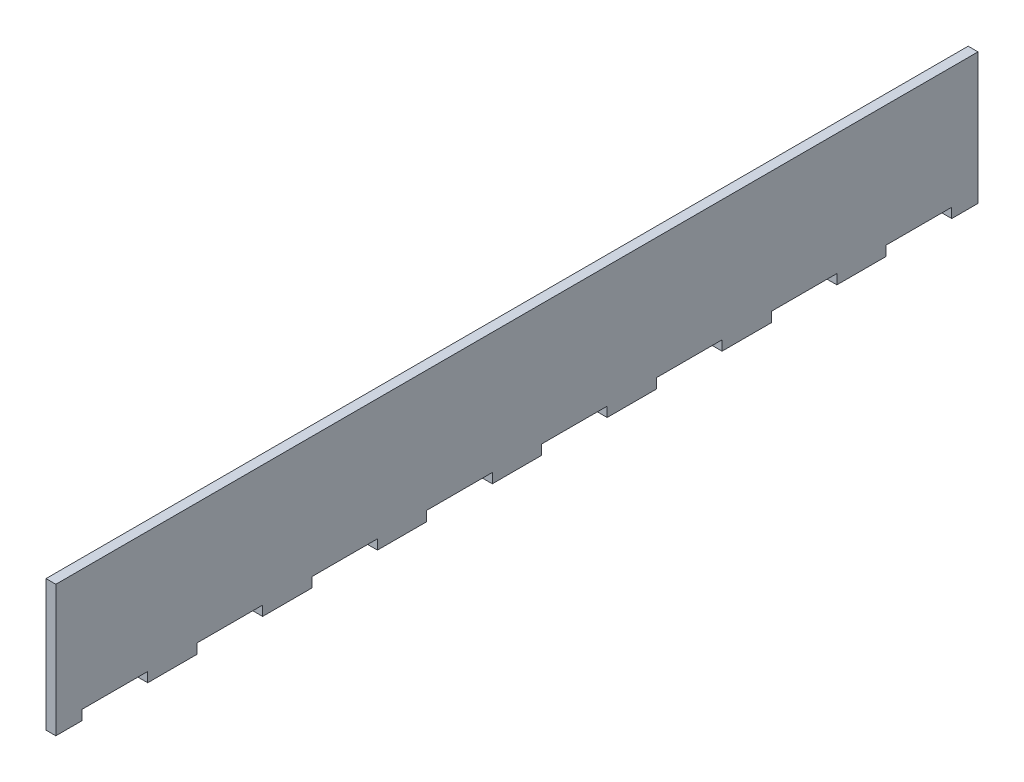
ISO-10303-21;
HEADER;
FILE_DESCRIPTION(('STEP AP214'),'2;1');
FILE_NAME('part.step','',(''),(''),'','','');
FILE_SCHEMA(('AUTOMOTIVE_DESIGN { 1 0 10303 214 1 1 1 1 }'));
ENDSEC;
DATA;
#1=APPLICATION_CONTEXT('core data for automotive mechanical design processes');
#2=APPLICATION_PROTOCOL_DEFINITION('international standard','automotive_design',2000,#1);
#3=PRODUCT_CONTEXT('',#1,'mechanical');
#4=PRODUCT('Part','Part','',(#3));
#5=PRODUCT_RELATED_PRODUCT_CATEGORY('part','',(#4));
#6=PRODUCT_DEFINITION_FORMATION('','',#4);
#7=PRODUCT_DEFINITION_CONTEXT('part definition',#1,'design');
#8=PRODUCT_DEFINITION('design','',#6,#7);
#9=PRODUCT_DEFINITION_SHAPE('','',#8);
#10=(LENGTH_UNIT() NAMED_UNIT(*) SI_UNIT(.MILLI.,.METRE.));
#11=(NAMED_UNIT(*) PLANE_ANGLE_UNIT() SI_UNIT($,.RADIAN.));
#12=(NAMED_UNIT(*) SI_UNIT($,.STERADIAN.) SOLID_ANGLE_UNIT());
#13=UNCERTAINTY_MEASURE_WITH_UNIT(LENGTH_MEASURE(1.E-05),#10,'distance_accuracy_value','');
#14=(GEOMETRIC_REPRESENTATION_CONTEXT(3) GLOBAL_UNCERTAINTY_ASSIGNED_CONTEXT((#13)) GLOBAL_UNIT_ASSIGNED_CONTEXT((#10,
#11,#12)) REPRESENTATION_CONTEXT('',''));
#15=CARTESIAN_POINT('',(0.,0.,0.));
#16=DIRECTION('',(0.,0.,1.));
#17=DIRECTION('',(1.,0.,0.));
#18=AXIS2_PLACEMENT_3D('',#15,#16,#17);
#19=CARTESIAN_POINT('',(3.,0.,0.));
#20=DIRECTION('',(0.,0.,1.));
#21=DIRECTION('',(1.,0.,0.));
#22=AXIS2_PLACEMENT_3D('',#19,#20,#21);
#23=PLANE('',#22);
#24=DIRECTION('',(0.,1.,0.));
#25=VECTOR('',#24,1.);
#26=CARTESIAN_POINT('',(0.,0.,0.));
#27=LINE('',#26,#25);
#28=CARTESIAN_POINT('',(0.,0.,0.));
#29=VERTEX_POINT('',#28);
#30=CARTESIAN_POINT('',(0.,40.,0.));
#31=VERTEX_POINT('',#30);
#32=EDGE_CURVE('E300',#29,#31,#27,.T.);
#33=ORIENTED_EDGE('',*,*,#32,.F.);
#34=DIRECTION('',(-1.,0.,0.));
#35=VECTOR('',#34,1.);
#36=CARTESIAN_POINT('',(3.,0.,0.));
#37=LINE('',#36,#35);
#38=CARTESIAN_POINT('',(3.,0.,0.));
#39=VERTEX_POINT('',#38);
#40=EDGE_CURVE('E11',#39,#29,#37,.T.);
#41=ORIENTED_EDGE('',*,*,#40,.F.);
#42=DIRECTION('',(0.,1.,0.));
#43=VECTOR('',#42,1.);
#44=CARTESIAN_POINT('',(3.,0.,0.));
#45=LINE('',#44,#43);
#46=CARTESIAN_POINT('',(3.,40.,0.));
#47=VERTEX_POINT('',#46);
#48=EDGE_CURVE('E387',#39,#47,#45,.T.);
#49=ORIENTED_EDGE('',*,*,#48,.T.);
#50=DIRECTION('',(-1.,0.,0.));
#51=VECTOR('',#50,1.);
#52=CARTESIAN_POINT('',(3.,40.,0.));
#53=LINE('',#52,#51);
#54=EDGE_CURVE('E36',#47,#31,#53,.T.);
#55=ORIENTED_EDGE('',*,*,#54,.T.);
#56=EDGE_LOOP('',(#33,#41,#49,#55));
#57=FACE_BOUND('',#56,.T.);
#58=ADVANCED_FACE('F33',(#57),#23,.T.);
#59=CARTESIAN_POINT('',(3.,0.,0.));
#60=DIRECTION('',(0.,1.,0.));
#61=DIRECTION('',(0.,0.,1.));
#62=AXIS2_PLACEMENT_3D('',#59,#60,#61);
#63=PLANE('',#62);
#64=DIRECTION('',(0.,0.,-1.));
#65=VECTOR('',#64,1.);
#66=CARTESIAN_POINT('',(0.,0.,0.));
#67=LINE('',#66,#65);
#68=CARTESIAN_POINT('',(0.,0.,-8.));
#69=VERTEX_POINT('',#68);
#70=EDGE_CURVE('E162',#29,#69,#67,.T.);
#71=ORIENTED_EDGE('',*,*,#70,.T.);
#72=DIRECTION('',(-1.,0.,0.));
#73=VECTOR('',#72,1.);
#74=CARTESIAN_POINT('',(3.,0.,-8.));
#75=LINE('',#74,#73);
#76=CARTESIAN_POINT('',(3.,0.,-8.));
#77=VERTEX_POINT('',#76);
#78=EDGE_CURVE('E42',#77,#69,#75,.T.);
#79=ORIENTED_EDGE('',*,*,#78,.F.);
#80=DIRECTION('',(0.,0.,-1.));
#81=VECTOR('',#80,1.);
#82=CARTESIAN_POINT('',(3.,0.,0.));
#83=LINE('',#82,#81);
#84=EDGE_CURVE('E278',#39,#77,#83,.T.);
#85=ORIENTED_EDGE('',*,*,#84,.F.);
#86=ORIENTED_EDGE('',*,*,#40,.T.);
#87=EDGE_LOOP('',(#71,#79,#85,#86));
#88=FACE_BOUND('',#87,.T.);
#89=ADVANCED_FACE('F691',(#88),#63,.F.);
#90=CARTESIAN_POINT('',(3.,0.,-8.));
#91=DIRECTION('',(0.,0.,1.));
#92=DIRECTION('',(1.,0.,0.));
#93=AXIS2_PLACEMENT_3D('',#90,#91,#92);
#94=PLANE('',#93);
#95=DIRECTION('',(0.,1.,0.));
#96=VECTOR('',#95,1.);
#97=CARTESIAN_POINT('',(0.,0.,-8.));
#98=LINE('',#97,#96);
#99=CARTESIAN_POINT('',(0.,3.,-8.));
#100=VERTEX_POINT('',#99);
#101=EDGE_CURVE('E285',#69,#100,#98,.T.);
#102=ORIENTED_EDGE('',*,*,#101,.T.);
#103=DIRECTION('',(-1.,0.,0.));
#104=VECTOR('',#103,1.);
#105=CARTESIAN_POINT('',(3.,3.,-8.));
#106=LINE('',#105,#104);
#107=CARTESIAN_POINT('',(3.,3.,-8.));
#108=VERTEX_POINT('',#107);
#109=EDGE_CURVE('E282',#108,#100,#106,.T.);
#110=ORIENTED_EDGE('',*,*,#109,.F.);
#111=DIRECTION('',(0.,1.,0.));
#112=VECTOR('',#111,1.);
#113=CARTESIAN_POINT('',(3.,0.,-8.));
#114=LINE('',#113,#112);
#115=EDGE_CURVE('E270',#77,#108,#114,.T.);
#116=ORIENTED_EDGE('',*,*,#115,.F.);
#117=ORIENTED_EDGE('',*,*,#78,.T.);
#118=EDGE_LOOP('',(#102,#110,#116,#117));
#119=FACE_BOUND('',#118,.T.);
#120=ADVANCED_FACE('F283',(#119),#94,.F.);
#121=CARTESIAN_POINT('',(3.,3.,-8.));
#122=DIRECTION('',(0.,1.,0.));
#123=DIRECTION('',(0.,0.,1.));
#124=AXIS2_PLACEMENT_3D('',#121,#122,#123);
#125=PLANE('',#124);
#126=DIRECTION('',(0.,0.,-1.));
#127=VECTOR('',#126,1.);
#128=CARTESIAN_POINT('',(0.,3.,-8.));
#129=LINE('',#128,#127);
#130=CARTESIAN_POINT('',(0.,3.,-28.));
#131=VERTEX_POINT('',#130);
#132=EDGE_CURVE('E384',#100,#131,#129,.T.);
#133=ORIENTED_EDGE('',*,*,#132,.T.);
#134=DIRECTION('',(-1.,0.,0.));
#135=VECTOR('',#134,1.);
#136=CARTESIAN_POINT('',(3.,3.,-28.));
#137=LINE('',#136,#135);
#138=CARTESIAN_POINT('',(3.,3.,-28.));
#139=VERTEX_POINT('',#138);
#140=EDGE_CURVE('E289',#139,#131,#137,.T.);
#141=ORIENTED_EDGE('',*,*,#140,.F.);
#142=DIRECTION('',(0.,0.,-1.));
#143=VECTOR('',#142,1.);
#144=CARTESIAN_POINT('',(3.,3.,-8.));
#145=LINE('',#144,#143);
#146=EDGE_CURVE('E276',#108,#139,#145,.T.);
#147=ORIENTED_EDGE('',*,*,#146,.F.);
#148=ORIENTED_EDGE('',*,*,#109,.T.);
#149=EDGE_LOOP('',(#133,#141,#147,#148));
#150=FACE_BOUND('',#149,.T.);
#151=ADVANCED_FACE('F291',(#150),#125,.F.);
#152=CARTESIAN_POINT('',(3.,0.,-28.));
#153=DIRECTION('',(0.,0.,1.));
#154=DIRECTION('',(1.,0.,0.));
#155=AXIS2_PLACEMENT_3D('',#152,#153,#154);
#156=PLANE('',#155);
#157=DIRECTION('',(0.,1.,0.));
#158=VECTOR('',#157,1.);
#159=CARTESIAN_POINT('',(0.,0.,-28.));
#160=LINE('',#159,#158);
#161=CARTESIAN_POINT('',(0.,0.,-28.));
#162=VERTEX_POINT('',#161);
#163=EDGE_CURVE('E381',#162,#131,#160,.T.);
#164=ORIENTED_EDGE('',*,*,#163,.F.);
#165=DIRECTION('',(-1.,0.,0.));
#166=VECTOR('',#165,1.);
#167=CARTESIAN_POINT('',(3.,0.,-28.));
#168=LINE('',#167,#166);
#169=CARTESIAN_POINT('',(3.,0.,-28.));
#170=VERTEX_POINT('',#169);
#171=EDGE_CURVE('E391',#170,#162,#168,.T.);
#172=ORIENTED_EDGE('',*,*,#171,.F.);
#173=DIRECTION('',(0.,1.,0.));
#174=VECTOR('',#173,1.);
#175=CARTESIAN_POINT('',(3.,0.,-28.));
#176=LINE('',#175,#174);
#177=EDGE_CURVE('E293',#170,#139,#176,.T.);
#178=ORIENTED_EDGE('',*,*,#177,.T.);
#179=ORIENTED_EDGE('',*,*,#140,.T.);
#180=EDGE_LOOP('',(#164,#172,#178,#179));
#181=FACE_BOUND('',#180,.T.);
#182=ADVANCED_FACE('F475',(#181),#156,.T.);
#183=CARTESIAN_POINT('',(3.,0.,-28.));
#184=DIRECTION('',(0.,1.,0.));
#185=DIRECTION('',(0.,0.,1.));
#186=AXIS2_PLACEMENT_3D('',#183,#184,#185);
#187=PLANE('',#186);
#188=DIRECTION('',(0.,0.,-1.));
#189=VECTOR('',#188,1.);
#190=CARTESIAN_POINT('',(0.,0.,-28.));
#191=LINE('',#190,#189);
#192=CARTESIAN_POINT('',(0.,0.,-43.));
#193=VERTEX_POINT('',#192);
#194=EDGE_CURVE('E379',#162,#193,#191,.T.);
#195=ORIENTED_EDGE('',*,*,#194,.T.);
#196=DIRECTION('',(-1.,0.,0.));
#197=VECTOR('',#196,1.);
#198=CARTESIAN_POINT('',(3.,0.,-43.));
#199=LINE('',#198,#197);
#200=CARTESIAN_POINT('',(3.,0.,-43.));
#201=VERTEX_POINT('',#200);
#202=EDGE_CURVE('E393',#201,#193,#199,.T.);
#203=ORIENTED_EDGE('',*,*,#202,.F.);
#204=DIRECTION('',(0.,0.,-1.));
#205=VECTOR('',#204,1.);
#206=CARTESIAN_POINT('',(3.,0.,-28.));
#207=LINE('',#206,#205);
#208=EDGE_CURVE('E295',#170,#201,#207,.T.);
#209=ORIENTED_EDGE('',*,*,#208,.F.);
#210=ORIENTED_EDGE('',*,*,#171,.T.);
#211=EDGE_LOOP('',(#195,#203,#209,#210));
#212=FACE_BOUND('',#211,.T.);
#213=ADVANCED_FACE('F482',(#212),#187,.F.);
#214=CARTESIAN_POINT('',(3.,0.,-43.));
#215=DIRECTION('',(0.,0.,1.));
#216=DIRECTION('',(1.,0.,0.));
#217=AXIS2_PLACEMENT_3D('',#214,#215,#216);
#218=PLANE('',#217);
#219=DIRECTION('',(0.,1.,0.));
#220=VECTOR('',#219,1.);
#221=CARTESIAN_POINT('',(0.,0.,-43.));
#222=LINE('',#221,#220);
#223=CARTESIAN_POINT('',(0.,3.,-43.));
#224=VERTEX_POINT('',#223);
#225=EDGE_CURVE('E377',#193,#224,#222,.T.);
#226=ORIENTED_EDGE('',*,*,#225,.T.);
#227=DIRECTION('',(-1.,0.,0.));
#228=VECTOR('',#227,1.);
#229=CARTESIAN_POINT('',(3.,3.,-43.));
#230=LINE('',#229,#228);
#231=CARTESIAN_POINT('',(3.,3.,-43.));
#232=VERTEX_POINT('',#231);
#233=EDGE_CURVE('E396',#232,#224,#230,.T.);
#234=ORIENTED_EDGE('',*,*,#233,.F.);
#235=DIRECTION('',(0.,1.,0.));
#236=VECTOR('',#235,1.);
#237=CARTESIAN_POINT('',(3.,0.,-43.));
#238=LINE('',#237,#236);
#239=EDGE_CURVE('E479',#201,#232,#238,.T.);
#240=ORIENTED_EDGE('',*,*,#239,.F.);
#241=ORIENTED_EDGE('',*,*,#202,.T.);
#242=EDGE_LOOP('',(#226,#234,#240,#241));
#243=FACE_BOUND('',#242,.T.);
#244=ADVANCED_FACE('F484',(#243),#218,.F.);
#245=CARTESIAN_POINT('',(3.,3.,-43.));
#246=DIRECTION('',(0.,1.,0.));
#247=DIRECTION('',(0.,0.,1.));
#248=AXIS2_PLACEMENT_3D('',#245,#246,#247);
#249=PLANE('',#248);
#250=DIRECTION('',(0.,0.,-1.));
#251=VECTOR('',#250,1.);
#252=CARTESIAN_POINT('',(0.,3.,-43.));
#253=LINE('',#252,#251);
#254=CARTESIAN_POINT('',(0.,3.,-63.));
#255=VERTEX_POINT('',#254);
#256=EDGE_CURVE('E374',#224,#255,#253,.T.);
#257=ORIENTED_EDGE('',*,*,#256,.T.);
#258=DIRECTION('',(-1.,0.,0.));
#259=VECTOR('',#258,1.);
#260=CARTESIAN_POINT('',(3.,3.,-63.));
#261=LINE('',#260,#259);
#262=CARTESIAN_POINT('',(3.,3.,-63.));
#263=VERTEX_POINT('',#262);
#264=EDGE_CURVE('E399',#263,#255,#261,.T.);
#265=ORIENTED_EDGE('',*,*,#264,.F.);
#266=DIRECTION('',(0.,0.,-1.));
#267=VECTOR('',#266,1.);
#268=CARTESIAN_POINT('',(3.,3.,-43.));
#269=LINE('',#268,#267);
#270=EDGE_CURVE('E486',#232,#263,#269,.T.);
#271=ORIENTED_EDGE('',*,*,#270,.F.);
#272=ORIENTED_EDGE('',*,*,#233,.T.);
#273=EDGE_LOOP('',(#257,#265,#271,#272));
#274=FACE_BOUND('',#273,.T.);
#275=ADVANCED_FACE('F681',(#274),#249,.F.);
#276=CARTESIAN_POINT('',(3.,0.,-63.));
#277=DIRECTION('',(0.,0.,1.));
#278=DIRECTION('',(1.,0.,0.));
#279=AXIS2_PLACEMENT_3D('',#276,#277,#278);
#280=PLANE('',#279);
#281=DIRECTION('',(0.,1.,0.));
#282=VECTOR('',#281,1.);
#283=CARTESIAN_POINT('',(0.,0.,-63.));
#284=LINE('',#283,#282);
#285=CARTESIAN_POINT('',(0.,0.,-63.));
#286=VERTEX_POINT('',#285);
#287=EDGE_CURVE('E371',#286,#255,#284,.T.);
#288=ORIENTED_EDGE('',*,*,#287,.F.);
#289=DIRECTION('',(-1.,0.,0.));
#290=VECTOR('',#289,1.);
#291=CARTESIAN_POINT('',(3.,0.,-63.));
#292=LINE('',#291,#290);
#293=CARTESIAN_POINT('',(3.,0.,-63.));
#294=VERTEX_POINT('',#293);
#295=EDGE_CURVE('E401',#294,#286,#292,.T.);
#296=ORIENTED_EDGE('',*,*,#295,.F.);
#297=DIRECTION('',(0.,1.,0.));
#298=VECTOR('',#297,1.);
#299=CARTESIAN_POINT('',(3.,0.,-63.));
#300=LINE('',#299,#298);
#301=EDGE_CURVE('E488',#294,#263,#300,.T.);
#302=ORIENTED_EDGE('',*,*,#301,.T.);
#303=ORIENTED_EDGE('',*,*,#264,.T.);
#304=EDGE_LOOP('',(#288,#296,#302,#303));
#305=FACE_BOUND('',#304,.T.);
#306=ADVANCED_FACE('F678',(#305),#280,.T.);
#307=CARTESIAN_POINT('',(3.,0.,-63.));
#308=DIRECTION('',(0.,1.,0.));
#309=DIRECTION('',(0.,0.,1.));
#310=AXIS2_PLACEMENT_3D('',#307,#308,#309);
#311=PLANE('',#310);
#312=DIRECTION('',(0.,0.,-1.));
#313=VECTOR('',#312,1.);
#314=CARTESIAN_POINT('',(0.,0.,-63.));
#315=LINE('',#314,#313);
#316=CARTESIAN_POINT('',(0.,0.,-78.));
#317=VERTEX_POINT('',#316);
#318=EDGE_CURVE('E369',#286,#317,#315,.T.);
#319=ORIENTED_EDGE('',*,*,#318,.T.);
#320=DIRECTION('',(-1.,0.,0.));
#321=VECTOR('',#320,1.);
#322=CARTESIAN_POINT('',(3.,0.,-78.));
#323=LINE('',#322,#321);
#324=CARTESIAN_POINT('',(3.,0.,-78.));
#325=VERTEX_POINT('',#324);
#326=EDGE_CURVE('E403',#325,#317,#323,.T.);
#327=ORIENTED_EDGE('',*,*,#326,.F.);
#328=DIRECTION('',(0.,0.,-1.));
#329=VECTOR('',#328,1.);
#330=CARTESIAN_POINT('',(3.,0.,-63.));
#331=LINE('',#330,#329);
#332=EDGE_CURVE('E493',#294,#325,#331,.T.);
#333=ORIENTED_EDGE('',*,*,#332,.F.);
#334=ORIENTED_EDGE('',*,*,#295,.T.);
#335=EDGE_LOOP('',(#319,#327,#333,#334));
#336=FACE_BOUND('',#335,.T.);
#337=ADVANCED_FACE('F673',(#336),#311,.F.);
#338=CARTESIAN_POINT('',(3.,0.,-78.));
#339=DIRECTION('',(0.,0.,1.));
#340=DIRECTION('',(1.,0.,0.));
#341=AXIS2_PLACEMENT_3D('',#338,#339,#340);
#342=PLANE('',#341);
#343=DIRECTION('',(0.,1.,0.));
#344=VECTOR('',#343,1.);
#345=CARTESIAN_POINT('',(0.,0.,-78.));
#346=LINE('',#345,#344);
#347=CARTESIAN_POINT('',(0.,3.,-78.));
#348=VERTEX_POINT('',#347);
#349=EDGE_CURVE('E367',#317,#348,#346,.T.);
#350=ORIENTED_EDGE('',*,*,#349,.T.);
#351=DIRECTION('',(-1.,0.,0.));
#352=VECTOR('',#351,1.);
#353=CARTESIAN_POINT('',(3.,3.,-78.));
#354=LINE('',#353,#352);
#355=CARTESIAN_POINT('',(3.,3.,-78.));
#356=VERTEX_POINT('',#355);
#357=EDGE_CURVE('E406',#356,#348,#354,.T.);
#358=ORIENTED_EDGE('',*,*,#357,.F.);
#359=DIRECTION('',(0.,1.,0.));
#360=VECTOR('',#359,1.);
#361=CARTESIAN_POINT('',(3.,0.,-78.));
#362=LINE('',#361,#360);
#363=EDGE_CURVE('E495',#325,#356,#362,.T.);
#364=ORIENTED_EDGE('',*,*,#363,.F.);
#365=ORIENTED_EDGE('',*,*,#326,.T.);
#366=EDGE_LOOP('',(#350,#358,#364,#365));
#367=FACE_BOUND('',#366,.T.);
#368=ADVANCED_FACE('F669',(#367),#342,.F.);
#369=CARTESIAN_POINT('',(3.,3.,-78.));
#370=DIRECTION('',(0.,1.,0.));
#371=DIRECTION('',(0.,0.,1.));
#372=AXIS2_PLACEMENT_3D('',#369,#370,#371);
#373=PLANE('',#372);
#374=DIRECTION('',(0.,0.,-1.));
#375=VECTOR('',#374,1.);
#376=CARTESIAN_POINT('',(0.,3.,-78.));
#377=LINE('',#376,#375);
#378=CARTESIAN_POINT('',(0.,3.,-98.));
#379=VERTEX_POINT('',#378);
#380=EDGE_CURVE('E364',#348,#379,#377,.T.);
#381=ORIENTED_EDGE('',*,*,#380,.T.);
#382=DIRECTION('',(-1.,0.,0.));
#383=VECTOR('',#382,1.);
#384=CARTESIAN_POINT('',(3.,3.,-98.));
#385=LINE('',#384,#383);
#386=CARTESIAN_POINT('',(3.,3.,-98.));
#387=VERTEX_POINT('',#386);
#388=EDGE_CURVE('E409',#387,#379,#385,.T.);
#389=ORIENTED_EDGE('',*,*,#388,.F.);
#390=DIRECTION('',(0.,0.,-1.));
#391=VECTOR('',#390,1.);
#392=CARTESIAN_POINT('',(3.,3.,-78.));
#393=LINE('',#392,#391);
#394=EDGE_CURVE('E497',#356,#387,#393,.T.);
#395=ORIENTED_EDGE('',*,*,#394,.F.);
#396=ORIENTED_EDGE('',*,*,#357,.T.);
#397=EDGE_LOOP('',(#381,#389,#395,#396));
#398=FACE_BOUND('',#397,.T.);
#399=ADVANCED_FACE('F664',(#398),#373,.F.);
#400=CARTESIAN_POINT('',(3.,0.,-98.));
#401=DIRECTION('',(0.,0.,1.));
#402=DIRECTION('',(1.,0.,0.));
#403=AXIS2_PLACEMENT_3D('',#400,#401,#402);
#404=PLANE('',#403);
#405=DIRECTION('',(0.,1.,0.));
#406=VECTOR('',#405,1.);
#407=CARTESIAN_POINT('',(0.,0.,-98.));
#408=LINE('',#407,#406);
#409=CARTESIAN_POINT('',(0.,0.,-98.));
#410=VERTEX_POINT('',#409);
#411=EDGE_CURVE('E361',#410,#379,#408,.T.);
#412=ORIENTED_EDGE('',*,*,#411,.F.);
#413=DIRECTION('',(-1.,0.,0.));
#414=VECTOR('',#413,1.);
#415=CARTESIAN_POINT('',(3.,0.,-98.));
#416=LINE('',#415,#414);
#417=CARTESIAN_POINT('',(3.,0.,-98.));
#418=VERTEX_POINT('',#417);
#419=EDGE_CURVE('E411',#418,#410,#416,.T.);
#420=ORIENTED_EDGE('',*,*,#419,.F.);
#421=DIRECTION('',(0.,1.,0.));
#422=VECTOR('',#421,1.);
#423=CARTESIAN_POINT('',(3.,0.,-98.));
#424=LINE('',#423,#422);
#425=EDGE_CURVE('E499',#418,#387,#424,.T.);
#426=ORIENTED_EDGE('',*,*,#425,.T.);
#427=ORIENTED_EDGE('',*,*,#388,.T.);
#428=EDGE_LOOP('',(#412,#420,#426,#427));
#429=FACE_BOUND('',#428,.T.);
#430=ADVANCED_FACE('F658',(#429),#404,.T.);
#431=CARTESIAN_POINT('',(3.,0.,-98.));
#432=DIRECTION('',(0.,1.,0.));
#433=DIRECTION('',(0.,0.,1.));
#434=AXIS2_PLACEMENT_3D('',#431,#432,#433);
#435=PLANE('',#434);
#436=DIRECTION('',(0.,0.,-1.));
#437=VECTOR('',#436,1.);
#438=CARTESIAN_POINT('',(0.,0.,-98.));
#439=LINE('',#438,#437);
#440=CARTESIAN_POINT('',(0.,0.,-113.));
#441=VERTEX_POINT('',#440);
#442=EDGE_CURVE('E359',#410,#441,#439,.T.);
#443=ORIENTED_EDGE('',*,*,#442,.T.);
#444=DIRECTION('',(-1.,0.,0.));
#445=VECTOR('',#444,1.);
#446=CARTESIAN_POINT('',(3.,0.,-113.));
#447=LINE('',#446,#445);
#448=CARTESIAN_POINT('',(3.,0.,-113.));
#449=VERTEX_POINT('',#448);
#450=EDGE_CURVE('E413',#449,#441,#447,.T.);
#451=ORIENTED_EDGE('',*,*,#450,.F.);
#452=DIRECTION('',(0.,0.,-1.));
#453=VECTOR('',#452,1.);
#454=CARTESIAN_POINT('',(3.,0.,-98.));
#455=LINE('',#454,#453);
#456=EDGE_CURVE('E502',#418,#449,#455,.T.);
#457=ORIENTED_EDGE('',*,*,#456,.F.);
#458=ORIENTED_EDGE('',*,*,#419,.T.);
#459=EDGE_LOOP('',(#443,#451,#457,#458));
#460=FACE_BOUND('',#459,.T.);
#461=ADVANCED_FACE('F655',(#460),#435,.F.);
#462=CARTESIAN_POINT('',(3.,0.,-113.));
#463=DIRECTION('',(0.,0.,1.));
#464=DIRECTION('',(1.,0.,0.));
#465=AXIS2_PLACEMENT_3D('',#462,#463,#464);
#466=PLANE('',#465);
#467=DIRECTION('',(0.,1.,0.));
#468=VECTOR('',#467,1.);
#469=CARTESIAN_POINT('',(0.,0.,-113.));
#470=LINE('',#469,#468);
#471=CARTESIAN_POINT('',(0.,3.,-113.));
#472=VERTEX_POINT('',#471);
#473=EDGE_CURVE('E357',#441,#472,#470,.T.);
#474=ORIENTED_EDGE('',*,*,#473,.T.);
#475=DIRECTION('',(-1.,0.,0.));
#476=VECTOR('',#475,1.);
#477=CARTESIAN_POINT('',(3.,3.,-113.));
#478=LINE('',#477,#476);
#479=CARTESIAN_POINT('',(3.,3.,-113.));
#480=VERTEX_POINT('',#479);
#481=EDGE_CURVE('E416',#480,#472,#478,.T.);
#482=ORIENTED_EDGE('',*,*,#481,.F.);
#483=DIRECTION('',(0.,1.,0.));
#484=VECTOR('',#483,1.);
#485=CARTESIAN_POINT('',(3.,0.,-113.));
#486=LINE('',#485,#484);
#487=EDGE_CURVE('E504',#449,#480,#486,.T.);
#488=ORIENTED_EDGE('',*,*,#487,.F.);
#489=ORIENTED_EDGE('',*,*,#450,.T.);
#490=EDGE_LOOP('',(#474,#482,#488,#489));
#491=FACE_BOUND('',#490,.T.);
#492=ADVANCED_FACE('F650',(#491),#466,.F.);
#493=CARTESIAN_POINT('',(3.,3.,-113.));
#494=DIRECTION('',(0.,1.,0.));
#495=DIRECTION('',(0.,0.,1.));
#496=AXIS2_PLACEMENT_3D('',#493,#494,#495);
#497=PLANE('',#496);
#498=DIRECTION('',(0.,0.,-1.));
#499=VECTOR('',#498,1.);
#500=CARTESIAN_POINT('',(0.,3.,-113.));
#501=LINE('',#500,#499);
#502=CARTESIAN_POINT('',(0.,3.,-133.));
#503=VERTEX_POINT('',#502);
#504=EDGE_CURVE('E354',#472,#503,#501,.T.);
#505=ORIENTED_EDGE('',*,*,#504,.T.);
#506=DIRECTION('',(-1.,0.,0.));
#507=VECTOR('',#506,1.);
#508=CARTESIAN_POINT('',(3.,3.,-133.));
#509=LINE('',#508,#507);
#510=CARTESIAN_POINT('',(3.,3.,-133.));
#511=VERTEX_POINT('',#510);
#512=EDGE_CURVE('E419',#511,#503,#509,.T.);
#513=ORIENTED_EDGE('',*,*,#512,.F.);
#514=DIRECTION('',(0.,0.,-1.));
#515=VECTOR('',#514,1.);
#516=CARTESIAN_POINT('',(3.,3.,-113.));
#517=LINE('',#516,#515);
#518=EDGE_CURVE('E506',#480,#511,#517,.T.);
#519=ORIENTED_EDGE('',*,*,#518,.F.);
#520=ORIENTED_EDGE('',*,*,#481,.T.);
#521=EDGE_LOOP('',(#505,#513,#519,#520));
#522=FACE_BOUND('',#521,.T.);
#523=ADVANCED_FACE('F644',(#522),#497,.F.);
#524=CARTESIAN_POINT('',(3.,0.,-133.));
#525=DIRECTION('',(0.,0.,1.));
#526=DIRECTION('',(1.,0.,0.));
#527=AXIS2_PLACEMENT_3D('',#524,#525,#526);
#528=PLANE('',#527);
#529=DIRECTION('',(0.,1.,0.));
#530=VECTOR('',#529,1.);
#531=CARTESIAN_POINT('',(0.,0.,-133.));
#532=LINE('',#531,#530);
#533=CARTESIAN_POINT('',(0.,0.,-133.));
#534=VERTEX_POINT('',#533);
#535=EDGE_CURVE('E351',#534,#503,#532,.T.);
#536=ORIENTED_EDGE('',*,*,#535,.F.);
#537=DIRECTION('',(-1.,0.,0.));
#538=VECTOR('',#537,1.);
#539=CARTESIAN_POINT('',(3.,0.,-133.));
#540=LINE('',#539,#538);
#541=CARTESIAN_POINT('',(3.,0.,-133.));
#542=VERTEX_POINT('',#541);
#543=EDGE_CURVE('E421',#542,#534,#540,.T.);
#544=ORIENTED_EDGE('',*,*,#543,.F.);
#545=DIRECTION('',(0.,1.,0.));
#546=VECTOR('',#545,1.);
#547=CARTESIAN_POINT('',(3.,0.,-133.));
#548=LINE('',#547,#546);
#549=EDGE_CURVE('E508',#542,#511,#548,.T.);
#550=ORIENTED_EDGE('',*,*,#549,.T.);
#551=ORIENTED_EDGE('',*,*,#512,.T.);
#552=EDGE_LOOP('',(#536,#544,#550,#551));
#553=FACE_BOUND('',#552,.T.);
#554=ADVANCED_FACE('F640',(#553),#528,.T.);
#555=CARTESIAN_POINT('',(3.,0.,-133.));
#556=DIRECTION('',(0.,1.,0.));
#557=DIRECTION('',(0.,0.,1.));
#558=AXIS2_PLACEMENT_3D('',#555,#556,#557);
#559=PLANE('',#558);
#560=DIRECTION('',(0.,0.,-1.));
#561=VECTOR('',#560,1.);
#562=CARTESIAN_POINT('',(0.,0.,-133.));
#563=LINE('',#562,#561);
#564=CARTESIAN_POINT('',(0.,0.,-148.));
#565=VERTEX_POINT('',#564);
#566=EDGE_CURVE('E349',#534,#565,#563,.T.);
#567=ORIENTED_EDGE('',*,*,#566,.T.);
#568=DIRECTION('',(-1.,0.,0.));
#569=VECTOR('',#568,1.);
#570=CARTESIAN_POINT('',(3.,0.,-148.));
#571=LINE('',#570,#569);
#572=CARTESIAN_POINT('',(3.,0.,-148.));
#573=VERTEX_POINT('',#572);
#574=EDGE_CURVE('E423',#573,#565,#571,.T.);
#575=ORIENTED_EDGE('',*,*,#574,.F.);
#576=DIRECTION('',(0.,0.,-1.));
#577=VECTOR('',#576,1.);
#578=CARTESIAN_POINT('',(3.,0.,-133.));
#579=LINE('',#578,#577);
#580=EDGE_CURVE('E511',#542,#573,#579,.T.);
#581=ORIENTED_EDGE('',*,*,#580,.F.);
#582=ORIENTED_EDGE('',*,*,#543,.T.);
#583=EDGE_LOOP('',(#567,#575,#581,#582));
#584=FACE_BOUND('',#583,.T.);
#585=ADVANCED_FACE('F635',(#584),#559,.F.);
#586=CARTESIAN_POINT('',(3.,0.,-148.));
#587=DIRECTION('',(0.,0.,1.));
#588=DIRECTION('',(1.,0.,0.));
#589=AXIS2_PLACEMENT_3D('',#586,#587,#588);
#590=PLANE('',#589);
#591=DIRECTION('',(0.,1.,0.));
#592=VECTOR('',#591,1.);
#593=CARTESIAN_POINT('',(0.,0.,-148.));
#594=LINE('',#593,#592);
#595=CARTESIAN_POINT('',(0.,3.,-148.));
#596=VERTEX_POINT('',#595);
#597=EDGE_CURVE('E347',#565,#596,#594,.T.);
#598=ORIENTED_EDGE('',*,*,#597,.T.);
#599=DIRECTION('',(-1.,0.,0.));
#600=VECTOR('',#599,1.);
#601=CARTESIAN_POINT('',(3.,3.,-148.));
#602=LINE('',#601,#600);
#603=CARTESIAN_POINT('',(3.,3.,-148.));
#604=VERTEX_POINT('',#603);
#605=EDGE_CURVE('E426',#604,#596,#602,.T.);
#606=ORIENTED_EDGE('',*,*,#605,.F.);
#607=DIRECTION('',(0.,1.,0.));
#608=VECTOR('',#607,1.);
#609=CARTESIAN_POINT('',(3.,0.,-148.));
#610=LINE('',#609,#608);
#611=EDGE_CURVE('E513',#573,#604,#610,.T.);
#612=ORIENTED_EDGE('',*,*,#611,.F.);
#613=ORIENTED_EDGE('',*,*,#574,.T.);
#614=EDGE_LOOP('',(#598,#606,#612,#613));
#615=FACE_BOUND('',#614,.T.);
#616=ADVANCED_FACE('F631',(#615),#590,.F.);
#617=CARTESIAN_POINT('',(3.,3.,-148.));
#618=DIRECTION('',(0.,1.,0.));
#619=DIRECTION('',(0.,0.,1.));
#620=AXIS2_PLACEMENT_3D('',#617,#618,#619);
#621=PLANE('',#620);
#622=DIRECTION('',(0.,0.,-1.));
#623=VECTOR('',#622,1.);
#624=CARTESIAN_POINT('',(0.,3.,-148.));
#625=LINE('',#624,#623);
#626=CARTESIAN_POINT('',(0.,3.,-168.));
#627=VERTEX_POINT('',#626);
#628=EDGE_CURVE('E344',#596,#627,#625,.T.);
#629=ORIENTED_EDGE('',*,*,#628,.T.);
#630=DIRECTION('',(-1.,0.,0.));
#631=VECTOR('',#630,1.);
#632=CARTESIAN_POINT('',(3.,3.,-168.));
#633=LINE('',#632,#631);
#634=CARTESIAN_POINT('',(3.,3.,-168.));
#635=VERTEX_POINT('',#634);
#636=EDGE_CURVE('E429',#635,#627,#633,.T.);
#637=ORIENTED_EDGE('',*,*,#636,.F.);
#638=DIRECTION('',(0.,0.,-1.));
#639=VECTOR('',#638,1.);
#640=CARTESIAN_POINT('',(3.,3.,-148.));
#641=LINE('',#640,#639);
#642=EDGE_CURVE('E515',#604,#635,#641,.T.);
#643=ORIENTED_EDGE('',*,*,#642,.F.);
#644=ORIENTED_EDGE('',*,*,#605,.T.);
#645=EDGE_LOOP('',(#629,#637,#643,#644));
#646=FACE_BOUND('',#645,.T.);
#647=ADVANCED_FACE('F626',(#646),#621,.F.);
#648=CARTESIAN_POINT('',(3.,0.,-168.));
#649=DIRECTION('',(0.,0.,1.));
#650=DIRECTION('',(1.,0.,0.));
#651=AXIS2_PLACEMENT_3D('',#648,#649,#650);
#652=PLANE('',#651);
#653=DIRECTION('',(0.,1.,0.));
#654=VECTOR('',#653,1.);
#655=CARTESIAN_POINT('',(0.,0.,-168.));
#656=LINE('',#655,#654);
#657=CARTESIAN_POINT('',(0.,0.,-168.));
#658=VERTEX_POINT('',#657);
#659=EDGE_CURVE('E341',#658,#627,#656,.T.);
#660=ORIENTED_EDGE('',*,*,#659,.F.);
#661=DIRECTION('',(-1.,0.,0.));
#662=VECTOR('',#661,1.);
#663=CARTESIAN_POINT('',(3.,0.,-168.));
#664=LINE('',#663,#662);
#665=CARTESIAN_POINT('',(3.,0.,-168.));
#666=VERTEX_POINT('',#665);
#667=EDGE_CURVE('E431',#666,#658,#664,.T.);
#668=ORIENTED_EDGE('',*,*,#667,.F.);
#669=DIRECTION('',(0.,1.,0.));
#670=VECTOR('',#669,1.);
#671=CARTESIAN_POINT('',(3.,0.,-168.));
#672=LINE('',#671,#670);
#673=EDGE_CURVE('E517',#666,#635,#672,.T.);
#674=ORIENTED_EDGE('',*,*,#673,.T.);
#675=ORIENTED_EDGE('',*,*,#636,.T.);
#676=EDGE_LOOP('',(#660,#668,#674,#675));
#677=FACE_BOUND('',#676,.T.);
#678=ADVANCED_FACE('F620',(#677),#652,.T.);
#679=CARTESIAN_POINT('',(3.,0.,-168.));
#680=DIRECTION('',(0.,1.,0.));
#681=DIRECTION('',(0.,0.,1.));
#682=AXIS2_PLACEMENT_3D('',#679,#680,#681);
#683=PLANE('',#682);
#684=DIRECTION('',(0.,0.,-1.));
#685=VECTOR('',#684,1.);
#686=CARTESIAN_POINT('',(0.,0.,-168.));
#687=LINE('',#686,#685);
#688=CARTESIAN_POINT('',(0.,0.,-183.));
#689=VERTEX_POINT('',#688);
#690=EDGE_CURVE('E339',#658,#689,#687,.T.);
#691=ORIENTED_EDGE('',*,*,#690,.T.);
#692=DIRECTION('',(-1.,0.,0.));
#693=VECTOR('',#692,1.);
#694=CARTESIAN_POINT('',(3.,0.,-183.));
#695=LINE('',#694,#693);
#696=CARTESIAN_POINT('',(3.,0.,-183.));
#697=VERTEX_POINT('',#696);
#698=EDGE_CURVE('E433',#697,#689,#695,.T.);
#699=ORIENTED_EDGE('',*,*,#698,.F.);
#700=DIRECTION('',(0.,0.,-1.));
#701=VECTOR('',#700,1.);
#702=CARTESIAN_POINT('',(3.,0.,-168.));
#703=LINE('',#702,#701);
#704=EDGE_CURVE('E520',#666,#697,#703,.T.);
#705=ORIENTED_EDGE('',*,*,#704,.F.);
#706=ORIENTED_EDGE('',*,*,#667,.T.);
#707=EDGE_LOOP('',(#691,#699,#705,#706));
#708=FACE_BOUND('',#707,.T.);
#709=ADVANCED_FACE('F617',(#708),#683,.F.);
#710=CARTESIAN_POINT('',(3.,0.,-183.));
#711=DIRECTION('',(0.,0.,1.));
#712=DIRECTION('',(1.,0.,0.));
#713=AXIS2_PLACEMENT_3D('',#710,#711,#712);
#714=PLANE('',#713);
#715=DIRECTION('',(0.,1.,0.));
#716=VECTOR('',#715,1.);
#717=CARTESIAN_POINT('',(0.,0.,-183.));
#718=LINE('',#717,#716);
#719=CARTESIAN_POINT('',(0.,3.,-183.));
#720=VERTEX_POINT('',#719);
#721=EDGE_CURVE('E337',#689,#720,#718,.T.);
#722=ORIENTED_EDGE('',*,*,#721,.T.);
#723=DIRECTION('',(-1.,0.,0.));
#724=VECTOR('',#723,1.);
#725=CARTESIAN_POINT('',(3.,3.,-183.));
#726=LINE('',#725,#724);
#727=CARTESIAN_POINT('',(3.,3.,-183.));
#728=VERTEX_POINT('',#727);
#729=EDGE_CURVE('E436',#728,#720,#726,.T.);
#730=ORIENTED_EDGE('',*,*,#729,.F.);
#731=DIRECTION('',(0.,1.,0.));
#732=VECTOR('',#731,1.);
#733=CARTESIAN_POINT('',(3.,0.,-183.));
#734=LINE('',#733,#732);
#735=EDGE_CURVE('E522',#697,#728,#734,.T.);
#736=ORIENTED_EDGE('',*,*,#735,.F.);
#737=ORIENTED_EDGE('',*,*,#698,.T.);
#738=EDGE_LOOP('',(#722,#730,#736,#737));
#739=FACE_BOUND('',#738,.T.);
#740=ADVANCED_FACE('F612',(#739),#714,.F.);
#741=CARTESIAN_POINT('',(3.,3.,-183.));
#742=DIRECTION('',(0.,1.,0.));
#743=DIRECTION('',(0.,0.,1.));
#744=AXIS2_PLACEMENT_3D('',#741,#742,#743);
#745=PLANE('',#744);
#746=DIRECTION('',(0.,0.,-1.));
#747=VECTOR('',#746,1.);
#748=CARTESIAN_POINT('',(0.,3.,-183.));
#749=LINE('',#748,#747);
#750=CARTESIAN_POINT('',(0.,3.,-203.));
#751=VERTEX_POINT('',#750);
#752=EDGE_CURVE('E334',#720,#751,#749,.T.);
#753=ORIENTED_EDGE('',*,*,#752,.T.);
#754=DIRECTION('',(-1.,0.,0.));
#755=VECTOR('',#754,1.);
#756=CARTESIAN_POINT('',(3.,3.,-203.));
#757=LINE('',#756,#755);
#758=CARTESIAN_POINT('',(3.,3.,-203.));
#759=VERTEX_POINT('',#758);
#760=EDGE_CURVE('E439',#759,#751,#757,.T.);
#761=ORIENTED_EDGE('',*,*,#760,.F.);
#762=DIRECTION('',(0.,0.,-1.));
#763=VECTOR('',#762,1.);
#764=CARTESIAN_POINT('',(3.,3.,-183.));
#765=LINE('',#764,#763);
#766=EDGE_CURVE('E524',#728,#759,#765,.T.);
#767=ORIENTED_EDGE('',*,*,#766,.F.);
#768=ORIENTED_EDGE('',*,*,#729,.T.);
#769=EDGE_LOOP('',(#753,#761,#767,#768));
#770=FACE_BOUND('',#769,.T.);
#771=ADVANCED_FACE('F606',(#770),#745,.F.);
#772=CARTESIAN_POINT('',(3.,0.,-203.));
#773=DIRECTION('',(0.,0.,1.));
#774=DIRECTION('',(1.,0.,0.));
#775=AXIS2_PLACEMENT_3D('',#772,#773,#774);
#776=PLANE('',#775);
#777=DIRECTION('',(0.,1.,0.));
#778=VECTOR('',#777,1.);
#779=CARTESIAN_POINT('',(0.,0.,-203.));
#780=LINE('',#779,#778);
#781=CARTESIAN_POINT('',(0.,0.,-203.));
#782=VERTEX_POINT('',#781);
#783=EDGE_CURVE('E331',#782,#751,#780,.T.);
#784=ORIENTED_EDGE('',*,*,#783,.F.);
#785=DIRECTION('',(-1.,0.,0.));
#786=VECTOR('',#785,1.);
#787=CARTESIAN_POINT('',(3.,0.,-203.));
#788=LINE('',#787,#786);
#789=CARTESIAN_POINT('',(3.,0.,-203.));
#790=VERTEX_POINT('',#789);
#791=EDGE_CURVE('E441',#790,#782,#788,.T.);
#792=ORIENTED_EDGE('',*,*,#791,.F.);
#793=DIRECTION('',(0.,1.,0.));
#794=VECTOR('',#793,1.);
#795=CARTESIAN_POINT('',(3.,0.,-203.));
#796=LINE('',#795,#794);
#797=EDGE_CURVE('E526',#790,#759,#796,.T.);
#798=ORIENTED_EDGE('',*,*,#797,.T.);
#799=ORIENTED_EDGE('',*,*,#760,.T.);
#800=EDGE_LOOP('',(#784,#792,#798,#799));
#801=FACE_BOUND('',#800,.T.);
#802=ADVANCED_FACE('F602',(#801),#776,.T.);
#803=CARTESIAN_POINT('',(3.,0.,-203.));
#804=DIRECTION('',(0.,1.,0.));
#805=DIRECTION('',(0.,0.,1.));
#806=AXIS2_PLACEMENT_3D('',#803,#804,#805);
#807=PLANE('',#806);
#808=DIRECTION('',(0.,0.,-1.));
#809=VECTOR('',#808,1.);
#810=CARTESIAN_POINT('',(0.,0.,-203.));
#811=LINE('',#810,#809);
#812=CARTESIAN_POINT('',(0.,0.,-218.));
#813=VERTEX_POINT('',#812);
#814=EDGE_CURVE('E329',#782,#813,#811,.T.);
#815=ORIENTED_EDGE('',*,*,#814,.T.);
#816=DIRECTION('',(-1.,0.,0.));
#817=VECTOR('',#816,1.);
#818=CARTESIAN_POINT('',(3.,0.,-218.));
#819=LINE('',#818,#817);
#820=CARTESIAN_POINT('',(3.,0.,-218.));
#821=VERTEX_POINT('',#820);
#822=EDGE_CURVE('E443',#821,#813,#819,.T.);
#823=ORIENTED_EDGE('',*,*,#822,.F.);
#824=DIRECTION('',(0.,0.,-1.));
#825=VECTOR('',#824,1.);
#826=CARTESIAN_POINT('',(3.,0.,-203.));
#827=LINE('',#826,#825);
#828=EDGE_CURVE('E529',#790,#821,#827,.T.);
#829=ORIENTED_EDGE('',*,*,#828,.F.);
#830=ORIENTED_EDGE('',*,*,#791,.T.);
#831=EDGE_LOOP('',(#815,#823,#829,#830));
#832=FACE_BOUND('',#831,.T.);
#833=ADVANCED_FACE('F597',(#832),#807,.F.);
#834=CARTESIAN_POINT('',(3.,0.,-218.));
#835=DIRECTION('',(0.,0.,1.));
#836=DIRECTION('',(1.,0.,0.));
#837=AXIS2_PLACEMENT_3D('',#834,#835,#836);
#838=PLANE('',#837);
#839=DIRECTION('',(0.,1.,0.));
#840=VECTOR('',#839,1.);
#841=CARTESIAN_POINT('',(0.,0.,-218.));
#842=LINE('',#841,#840);
#843=CARTESIAN_POINT('',(0.,3.,-218.));
#844=VERTEX_POINT('',#843);
#845=EDGE_CURVE('E327',#813,#844,#842,.T.);
#846=ORIENTED_EDGE('',*,*,#845,.T.);
#847=DIRECTION('',(-1.,0.,0.));
#848=VECTOR('',#847,1.);
#849=CARTESIAN_POINT('',(3.,3.,-218.));
#850=LINE('',#849,#848);
#851=CARTESIAN_POINT('',(3.,3.,-218.));
#852=VERTEX_POINT('',#851);
#853=EDGE_CURVE('E446',#852,#844,#850,.T.);
#854=ORIENTED_EDGE('',*,*,#853,.F.);
#855=DIRECTION('',(0.,1.,0.));
#856=VECTOR('',#855,1.);
#857=CARTESIAN_POINT('',(3.,0.,-218.));
#858=LINE('',#857,#856);
#859=EDGE_CURVE('E531',#821,#852,#858,.T.);
#860=ORIENTED_EDGE('',*,*,#859,.F.);
#861=ORIENTED_EDGE('',*,*,#822,.T.);
#862=EDGE_LOOP('',(#846,#854,#860,#861));
#863=FACE_BOUND('',#862,.T.);
#864=ADVANCED_FACE('F593',(#863),#838,.F.);
#865=CARTESIAN_POINT('',(3.,3.,-218.));
#866=DIRECTION('',(0.,1.,0.));
#867=DIRECTION('',(0.,0.,1.));
#868=AXIS2_PLACEMENT_3D('',#865,#866,#867);
#869=PLANE('',#868);
#870=DIRECTION('',(0.,0.,-1.));
#871=VECTOR('',#870,1.);
#872=CARTESIAN_POINT('',(0.,3.,-218.));
#873=LINE('',#872,#871);
#874=CARTESIAN_POINT('',(0.,3.,-238.));
#875=VERTEX_POINT('',#874);
#876=EDGE_CURVE('E324',#844,#875,#873,.T.);
#877=ORIENTED_EDGE('',*,*,#876,.T.);
#878=DIRECTION('',(-1.,0.,0.));
#879=VECTOR('',#878,1.);
#880=CARTESIAN_POINT('',(3.,3.,-238.));
#881=LINE('',#880,#879);
#882=CARTESIAN_POINT('',(3.,3.,-238.));
#883=VERTEX_POINT('',#882);
#884=EDGE_CURVE('E449',#883,#875,#881,.T.);
#885=ORIENTED_EDGE('',*,*,#884,.F.);
#886=DIRECTION('',(0.,0.,-1.));
#887=VECTOR('',#886,1.);
#888=CARTESIAN_POINT('',(3.,3.,-218.));
#889=LINE('',#888,#887);
#890=EDGE_CURVE('E533',#852,#883,#889,.T.);
#891=ORIENTED_EDGE('',*,*,#890,.F.);
#892=ORIENTED_EDGE('',*,*,#853,.T.);
#893=EDGE_LOOP('',(#877,#885,#891,#892));
#894=FACE_BOUND('',#893,.T.);
#895=ADVANCED_FACE('F588',(#894),#869,.F.);
#896=CARTESIAN_POINT('',(3.,0.,-238.));
#897=DIRECTION('',(0.,0.,1.));
#898=DIRECTION('',(1.,0.,0.));
#899=AXIS2_PLACEMENT_3D('',#896,#897,#898);
#900=PLANE('',#899);
#901=DIRECTION('',(0.,1.,0.));
#902=VECTOR('',#901,1.);
#903=CARTESIAN_POINT('',(0.,0.,-238.));
#904=LINE('',#903,#902);
#905=CARTESIAN_POINT('',(0.,0.,-238.));
#906=VERTEX_POINT('',#905);
#907=EDGE_CURVE('E321',#906,#875,#904,.T.);
#908=ORIENTED_EDGE('',*,*,#907,.F.);
#909=DIRECTION('',(-1.,0.,0.));
#910=VECTOR('',#909,1.);
#911=CARTESIAN_POINT('',(3.,0.,-238.));
#912=LINE('',#911,#910);
#913=CARTESIAN_POINT('',(3.,0.,-238.));
#914=VERTEX_POINT('',#913);
#915=EDGE_CURVE('E451',#914,#906,#912,.T.);
#916=ORIENTED_EDGE('',*,*,#915,.F.);
#917=DIRECTION('',(0.,1.,0.));
#918=VECTOR('',#917,1.);
#919=CARTESIAN_POINT('',(3.,0.,-238.));
#920=LINE('',#919,#918);
#921=EDGE_CURVE('E535',#914,#883,#920,.T.);
#922=ORIENTED_EDGE('',*,*,#921,.T.);
#923=ORIENTED_EDGE('',*,*,#884,.T.);
#924=EDGE_LOOP('',(#908,#916,#922,#923));
#925=FACE_BOUND('',#924,.T.);
#926=ADVANCED_FACE('F582',(#925),#900,.T.);
#927=CARTESIAN_POINT('',(3.,0.,-238.));
#928=DIRECTION('',(0.,1.,0.));
#929=DIRECTION('',(0.,0.,1.));
#930=AXIS2_PLACEMENT_3D('',#927,#928,#929);
#931=PLANE('',#930);
#932=DIRECTION('',(0.,0.,-1.));
#933=VECTOR('',#932,1.);
#934=CARTESIAN_POINT('',(0.,0.,-238.));
#935=LINE('',#934,#933);
#936=CARTESIAN_POINT('',(0.,0.,-253.));
#937=VERTEX_POINT('',#936);
#938=EDGE_CURVE('E319',#906,#937,#935,.T.);
#939=ORIENTED_EDGE('',*,*,#938,.T.);
#940=DIRECTION('',(-1.,0.,0.));
#941=VECTOR('',#940,1.);
#942=CARTESIAN_POINT('',(3.,0.,-253.));
#943=LINE('',#942,#941);
#944=CARTESIAN_POINT('',(3.,0.,-253.));
#945=VERTEX_POINT('',#944);
#946=EDGE_CURVE('E453',#945,#937,#943,.T.);
#947=ORIENTED_EDGE('',*,*,#946,.F.);
#948=DIRECTION('',(0.,0.,-1.));
#949=VECTOR('',#948,1.);
#950=CARTESIAN_POINT('',(3.,0.,-238.));
#951=LINE('',#950,#949);
#952=EDGE_CURVE('E538',#914,#945,#951,.T.);
#953=ORIENTED_EDGE('',*,*,#952,.F.);
#954=ORIENTED_EDGE('',*,*,#915,.T.);
#955=EDGE_LOOP('',(#939,#947,#953,#954));
#956=FACE_BOUND('',#955,.T.);
#957=ADVANCED_FACE('F579',(#956),#931,.F.);
#958=CARTESIAN_POINT('',(3.,0.,-253.));
#959=DIRECTION('',(0.,0.,1.));
#960=DIRECTION('',(1.,0.,0.));
#961=AXIS2_PLACEMENT_3D('',#958,#959,#960);
#962=PLANE('',#961);
#963=DIRECTION('',(0.,1.,0.));
#964=VECTOR('',#963,1.);
#965=CARTESIAN_POINT('',(0.,0.,-253.));
#966=LINE('',#965,#964);
#967=CARTESIAN_POINT('',(0.,3.,-253.));
#968=VERTEX_POINT('',#967);
#969=EDGE_CURVE('E317',#937,#968,#966,.T.);
#970=ORIENTED_EDGE('',*,*,#969,.T.);
#971=DIRECTION('',(-1.,0.,0.));
#972=VECTOR('',#971,1.);
#973=CARTESIAN_POINT('',(3.,3.,-253.));
#974=LINE('',#973,#972);
#975=CARTESIAN_POINT('',(3.,3.,-253.));
#976=VERTEX_POINT('',#975);
#977=EDGE_CURVE('E456',#976,#968,#974,.T.);
#978=ORIENTED_EDGE('',*,*,#977,.F.);
#979=DIRECTION('',(0.,1.,0.));
#980=VECTOR('',#979,1.);
#981=CARTESIAN_POINT('',(3.,0.,-253.));
#982=LINE('',#981,#980);
#983=EDGE_CURVE('E540',#945,#976,#982,.T.);
#984=ORIENTED_EDGE('',*,*,#983,.F.);
#985=ORIENTED_EDGE('',*,*,#946,.T.);
#986=EDGE_LOOP('',(#970,#978,#984,#985));
#987=FACE_BOUND('',#986,.T.);
#988=ADVANCED_FACE('F574',(#987),#962,.F.);
#989=CARTESIAN_POINT('',(3.,3.,-253.));
#990=DIRECTION('',(0.,1.,0.));
#991=DIRECTION('',(0.,0.,1.));
#992=AXIS2_PLACEMENT_3D('',#989,#990,#991);
#993=PLANE('',#992);
#994=DIRECTION('',(0.,0.,-1.));
#995=VECTOR('',#994,1.);
#996=CARTESIAN_POINT('',(0.,3.,-253.));
#997=LINE('',#996,#995);
#998=CARTESIAN_POINT('',(0.,3.,-273.));
#999=VERTEX_POINT('',#998);
#1000=EDGE_CURVE('E314',#968,#999,#997,.T.);
#1001=ORIENTED_EDGE('',*,*,#1000,.T.);
#1002=DIRECTION('',(-1.,0.,0.));
#1003=VECTOR('',#1002,1.);
#1004=CARTESIAN_POINT('',(3.,3.,-273.));
#1005=LINE('',#1004,#1003);
#1006=CARTESIAN_POINT('',(3.,3.,-273.));
#1007=VERTEX_POINT('',#1006);
#1008=EDGE_CURVE('E459',#1007,#999,#1005,.T.);
#1009=ORIENTED_EDGE('',*,*,#1008,.F.);
#1010=DIRECTION('',(0.,0.,-1.));
#1011=VECTOR('',#1010,1.);
#1012=CARTESIAN_POINT('',(3.,3.,-253.));
#1013=LINE('',#1012,#1011);
#1014=EDGE_CURVE('E542',#976,#1007,#1013,.T.);
#1015=ORIENTED_EDGE('',*,*,#1014,.F.);
#1016=ORIENTED_EDGE('',*,*,#977,.T.);
#1017=EDGE_LOOP('',(#1001,#1009,#1015,#1016));
#1018=FACE_BOUND('',#1017,.T.);
#1019=ADVANCED_FACE('F568',(#1018),#993,.F.);
#1020=CARTESIAN_POINT('',(3.,0.,-273.));
#1021=DIRECTION('',(0.,0.,1.));
#1022=DIRECTION('',(1.,0.,0.));
#1023=AXIS2_PLACEMENT_3D('',#1020,#1021,#1022);
#1024=PLANE('',#1023);
#1025=DIRECTION('',(0.,1.,0.));
#1026=VECTOR('',#1025,1.);
#1027=CARTESIAN_POINT('',(0.,0.,-273.));
#1028=LINE('',#1027,#1026);
#1029=CARTESIAN_POINT('',(0.,0.,-273.));
#1030=VERTEX_POINT('',#1029);
#1031=EDGE_CURVE('E311',#1030,#999,#1028,.T.);
#1032=ORIENTED_EDGE('',*,*,#1031,.F.);
#1033=DIRECTION('',(-1.,0.,0.));
#1034=VECTOR('',#1033,1.);
#1035=CARTESIAN_POINT('',(3.,0.,-273.));
#1036=LINE('',#1035,#1034);
#1037=CARTESIAN_POINT('',(3.,0.,-273.));
#1038=VERTEX_POINT('',#1037);
#1039=EDGE_CURVE('E461',#1038,#1030,#1036,.T.);
#1040=ORIENTED_EDGE('',*,*,#1039,.F.);
#1041=DIRECTION('',(0.,1.,0.));
#1042=VECTOR('',#1041,1.);
#1043=CARTESIAN_POINT('',(3.,0.,-273.));
#1044=LINE('',#1043,#1042);
#1045=EDGE_CURVE('E544',#1038,#1007,#1044,.T.);
#1046=ORIENTED_EDGE('',*,*,#1045,.T.);
#1047=ORIENTED_EDGE('',*,*,#1008,.T.);
#1048=EDGE_LOOP('',(#1032,#1040,#1046,#1047));
#1049=FACE_BOUND('',#1048,.T.);
#1050=ADVANCED_FACE('F564',(#1049),#1024,.T.);
#1051=CARTESIAN_POINT('',(3.,0.,-273.));
#1052=DIRECTION('',(0.,1.,0.));
#1053=DIRECTION('',(0.,0.,1.));
#1054=AXIS2_PLACEMENT_3D('',#1051,#1052,#1053);
#1055=PLANE('',#1054);
#1056=DIRECTION('',(0.,0.,-1.));
#1057=VECTOR('',#1056,1.);
#1058=CARTESIAN_POINT('',(0.,0.,-273.));
#1059=LINE('',#1058,#1057);
#1060=CARTESIAN_POINT('',(0.,0.,-281.));
#1061=VERTEX_POINT('',#1060);
#1062=EDGE_CURVE('E309',#1030,#1061,#1059,.T.);
#1063=ORIENTED_EDGE('',*,*,#1062,.T.);
#1064=DIRECTION('',(-1.,0.,0.));
#1065=VECTOR('',#1064,1.);
#1066=CARTESIAN_POINT('',(3.,0.,-281.));
#1067=LINE('',#1066,#1065);
#1068=CARTESIAN_POINT('',(3.,0.,-281.));
#1069=VERTEX_POINT('',#1068);
#1070=EDGE_CURVE('E463',#1069,#1061,#1067,.T.);
#1071=ORIENTED_EDGE('',*,*,#1070,.F.);
#1072=DIRECTION('',(0.,0.,-1.));
#1073=VECTOR('',#1072,1.);
#1074=CARTESIAN_POINT('',(3.,0.,-273.));
#1075=LINE('',#1074,#1073);
#1076=EDGE_CURVE('E547',#1038,#1069,#1075,.T.);
#1077=ORIENTED_EDGE('',*,*,#1076,.F.);
#1078=ORIENTED_EDGE('',*,*,#1039,.T.);
#1079=EDGE_LOOP('',(#1063,#1071,#1077,#1078));
#1080=FACE_BOUND('',#1079,.T.);
#1081=ADVANCED_FACE('F919',(#1080),#1055,.F.);
#1082=CARTESIAN_POINT('',(3.,0.,-281.));
#1083=DIRECTION('',(0.,0.,1.));
#1084=DIRECTION('',(1.,0.,0.));
#1085=AXIS2_PLACEMENT_3D('',#1082,#1083,#1084);
#1086=PLANE('',#1085);
#1087=DIRECTION('',(0.,1.,0.));
#1088=VECTOR('',#1087,1.);
#1089=CARTESIAN_POINT('',(0.,0.,-281.));
#1090=LINE('',#1089,#1088);
#1091=CARTESIAN_POINT('',(0.,40.,-281.));
#1092=VERTEX_POINT('',#1091);
#1093=EDGE_CURVE('E306',#1061,#1092,#1090,.T.);
#1094=ORIENTED_EDGE('',*,*,#1093,.T.);
#1095=DIRECTION('',(-1.,0.,0.));
#1096=VECTOR('',#1095,1.);
#1097=CARTESIAN_POINT('',(3.,40.,-281.));
#1098=LINE('',#1097,#1096);
#1099=CARTESIAN_POINT('',(3.,40.,-281.));
#1100=VERTEX_POINT('',#1099);
#1101=EDGE_CURVE('E465',#1100,#1092,#1098,.T.);
#1102=ORIENTED_EDGE('',*,*,#1101,.F.);
#1103=DIRECTION('',(0.,1.,0.));
#1104=VECTOR('',#1103,1.);
#1105=CARTESIAN_POINT('',(3.,0.,-281.));
#1106=LINE('',#1105,#1104);
#1107=EDGE_CURVE('E549',#1069,#1100,#1106,.T.);
#1108=ORIENTED_EDGE('',*,*,#1107,.F.);
#1109=ORIENTED_EDGE('',*,*,#1070,.T.);
#1110=EDGE_LOOP('',(#1094,#1102,#1108,#1109));
#1111=FACE_BOUND('',#1110,.T.);
#1112=ADVANCED_FACE('F558',(#1111),#1086,.F.);
#1113=CARTESIAN_POINT('',(3.,40.,0.));
#1114=DIRECTION('',(0.,1.,0.));
#1115=DIRECTION('',(0.,0.,1.));
#1116=AXIS2_PLACEMENT_3D('',#1113,#1114,#1115);
#1117=PLANE('',#1116);
#1118=DIRECTION('',(0.,0.,-1.));
#1119=VECTOR('',#1118,1.);
#1120=CARTESIAN_POINT('',(0.,40.,0.));
#1121=LINE('',#1120,#1119);
#1122=EDGE_CURVE('E303',#31,#1092,#1121,.T.);
#1123=ORIENTED_EDGE('',*,*,#1122,.F.);
#1124=ORIENTED_EDGE('',*,*,#54,.F.);
#1125=DIRECTION('',(0.,0.,-1.));
#1126=VECTOR('',#1125,1.);
#1127=CARTESIAN_POINT('',(3.,40.,0.));
#1128=LINE('',#1127,#1126);
#1129=EDGE_CURVE('E551',#47,#1100,#1128,.T.);
#1130=ORIENTED_EDGE('',*,*,#1129,.T.);
#1131=ORIENTED_EDGE('',*,*,#1101,.T.);
#1132=EDGE_LOOP('',(#1123,#1124,#1130,#1131));
#1133=FACE_BOUND('',#1132,.T.);
#1134=ADVANCED_FACE('F467',(#1133),#1117,.T.);
#1135=CARTESIAN_POINT('',(3.,0.,0.));
#1136=DIRECTION('',(-1.,0.,0.));
#1137=DIRECTION('',(0.,0.,1.));
#1138=AXIS2_PLACEMENT_3D('',#1135,#1136,#1137);
#1139=PLANE('',#1138);
#1140=ORIENTED_EDGE('',*,*,#48,.F.);
#1141=ORIENTED_EDGE('',*,*,#84,.T.);
#1142=ORIENTED_EDGE('',*,*,#115,.T.);
#1143=ORIENTED_EDGE('',*,*,#146,.T.);
#1144=ORIENTED_EDGE('',*,*,#177,.F.);
#1145=ORIENTED_EDGE('',*,*,#208,.T.);
#1146=ORIENTED_EDGE('',*,*,#239,.T.);
#1147=ORIENTED_EDGE('',*,*,#270,.T.);
#1148=ORIENTED_EDGE('',*,*,#301,.F.);
#1149=ORIENTED_EDGE('',*,*,#332,.T.);
#1150=ORIENTED_EDGE('',*,*,#363,.T.);
#1151=ORIENTED_EDGE('',*,*,#394,.T.);
#1152=ORIENTED_EDGE('',*,*,#425,.F.);
#1153=ORIENTED_EDGE('',*,*,#456,.T.);
#1154=ORIENTED_EDGE('',*,*,#487,.T.);
#1155=ORIENTED_EDGE('',*,*,#518,.T.);
#1156=ORIENTED_EDGE('',*,*,#549,.F.);
#1157=ORIENTED_EDGE('',*,*,#580,.T.);
#1158=ORIENTED_EDGE('',*,*,#611,.T.);
#1159=ORIENTED_EDGE('',*,*,#642,.T.);
#1160=ORIENTED_EDGE('',*,*,#673,.F.);
#1161=ORIENTED_EDGE('',*,*,#704,.T.);
#1162=ORIENTED_EDGE('',*,*,#735,.T.);
#1163=ORIENTED_EDGE('',*,*,#766,.T.);
#1164=ORIENTED_EDGE('',*,*,#797,.F.);
#1165=ORIENTED_EDGE('',*,*,#828,.T.);
#1166=ORIENTED_EDGE('',*,*,#859,.T.);
#1167=ORIENTED_EDGE('',*,*,#890,.T.);
#1168=ORIENTED_EDGE('',*,*,#921,.F.);
#1169=ORIENTED_EDGE('',*,*,#952,.T.);
#1170=ORIENTED_EDGE('',*,*,#983,.T.);
#1171=ORIENTED_EDGE('',*,*,#1014,.T.);
#1172=ORIENTED_EDGE('',*,*,#1045,.F.);
#1173=ORIENTED_EDGE('',*,*,#1076,.T.);
#1174=ORIENTED_EDGE('',*,*,#1107,.T.);
#1175=ORIENTED_EDGE('',*,*,#1129,.F.);
#1176=EDGE_LOOP('',(#1140,#1141,#1142,#1143,#1144,#1145,#1146,#1147,#1148,#1149,#1150,#1151,
#1152,#1153,#1154,#1155,#1156,#1157,#1158,#1159,#1160,#1161,#1162,#1163,#1164,#1165,#1166,#1167,
#1168,#1169,#1170,#1171,#1172,#1173,#1174,#1175));
#1177=FACE_BOUND('',#1176,.T.);
#1178=ADVANCED_FACE('F273',(#1177),#1139,.F.);
#1179=CARTESIAN_POINT('',(0.,0.,0.));
#1180=DIRECTION('',(-1.,0.,0.));
#1181=DIRECTION('',(0.,0.,1.));
#1182=AXIS2_PLACEMENT_3D('',#1179,#1180,#1181);
#1183=PLANE('',#1182);
#1184=ORIENTED_EDGE('',*,*,#32,.T.);
#1185=ORIENTED_EDGE('',*,*,#1122,.T.);
#1186=ORIENTED_EDGE('',*,*,#1093,.F.);
#1187=ORIENTED_EDGE('',*,*,#1062,.F.);
#1188=ORIENTED_EDGE('',*,*,#1031,.T.);
#1189=ORIENTED_EDGE('',*,*,#1000,.F.);
#1190=ORIENTED_EDGE('',*,*,#969,.F.);
#1191=ORIENTED_EDGE('',*,*,#938,.F.);
#1192=ORIENTED_EDGE('',*,*,#907,.T.);
#1193=ORIENTED_EDGE('',*,*,#876,.F.);
#1194=ORIENTED_EDGE('',*,*,#845,.F.);
#1195=ORIENTED_EDGE('',*,*,#814,.F.);
#1196=ORIENTED_EDGE('',*,*,#783,.T.);
#1197=ORIENTED_EDGE('',*,*,#752,.F.);
#1198=ORIENTED_EDGE('',*,*,#721,.F.);
#1199=ORIENTED_EDGE('',*,*,#690,.F.);
#1200=ORIENTED_EDGE('',*,*,#659,.T.);
#1201=ORIENTED_EDGE('',*,*,#628,.F.);
#1202=ORIENTED_EDGE('',*,*,#597,.F.);
#1203=ORIENTED_EDGE('',*,*,#566,.F.);
#1204=ORIENTED_EDGE('',*,*,#535,.T.);
#1205=ORIENTED_EDGE('',*,*,#504,.F.);
#1206=ORIENTED_EDGE('',*,*,#473,.F.);
#1207=ORIENTED_EDGE('',*,*,#442,.F.);
#1208=ORIENTED_EDGE('',*,*,#411,.T.);
#1209=ORIENTED_EDGE('',*,*,#380,.F.);
#1210=ORIENTED_EDGE('',*,*,#349,.F.);
#1211=ORIENTED_EDGE('',*,*,#318,.F.);
#1212=ORIENTED_EDGE('',*,*,#287,.T.);
#1213=ORIENTED_EDGE('',*,*,#256,.F.);
#1214=ORIENTED_EDGE('',*,*,#225,.F.);
#1215=ORIENTED_EDGE('',*,*,#194,.F.);
#1216=ORIENTED_EDGE('',*,*,#163,.T.);
#1217=ORIENTED_EDGE('',*,*,#132,.F.);
#1218=ORIENTED_EDGE('',*,*,#101,.F.);
#1219=ORIENTED_EDGE('',*,*,#70,.F.);
#1220=EDGE_LOOP('',(#1184,#1185,#1186,#1187,#1188,#1189,#1190,#1191,#1192,#1193,#1194,#1195,
#1196,#1197,#1198,#1199,#1200,#1201,#1202,#1203,#1204,#1205,#1206,#1207,#1208,#1209,#1210,#1211,
#1212,#1213,#1214,#1215,#1216,#1217,#1218,#1219));
#1221=FACE_BOUND('',#1220,.T.);
#1222=ADVANCED_FACE('F470',(#1221),#1183,.T.);
#1223=CLOSED_SHELL('',(#58,#89,#120,#151,#182,#213,#244,#275,#306,#337,#368,#399,#430,#461,#492,
#523,#554,#585,#616,#647,#678,#709,#740,#771,#802,#833,#864,#895,#926,#957,#988,#1019,#1050,
#1081,#1112,#1134,#1178,#1222));
#1224=MANIFOLD_SOLID_BREP('B2',#1223);
#1225=ADVANCED_BREP_SHAPE_REPRESENTATION('',(#18,#1224),#14);
#1226=SHAPE_DEFINITION_REPRESENTATION(#9,#1225);
ENDSEC;
END-ISO-10303-21;
